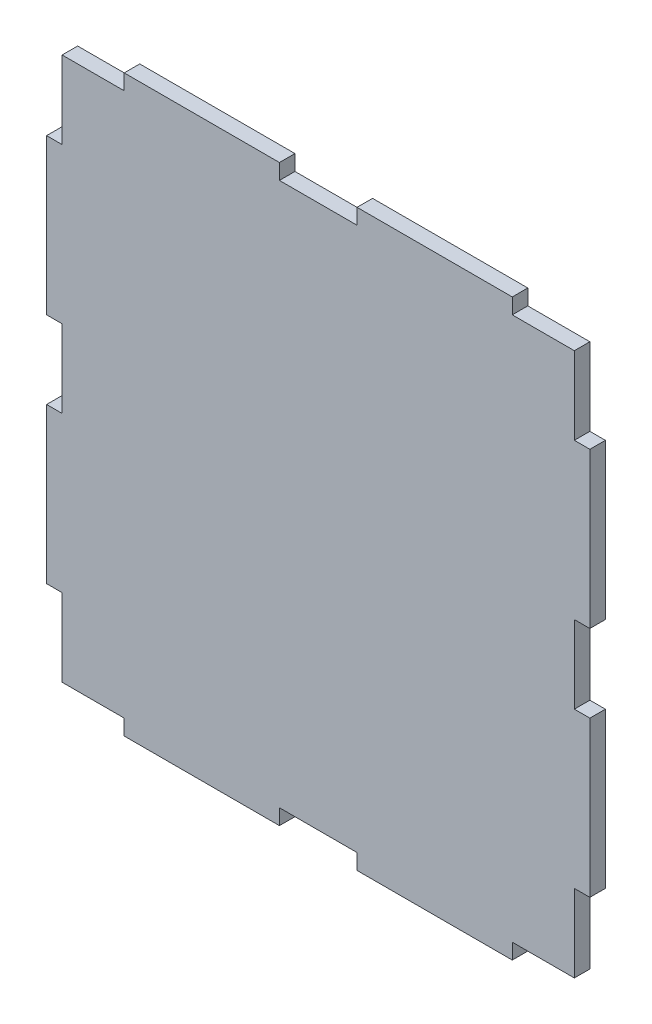
ISO-10303-21;
HEADER;
FILE_DESCRIPTION(('STEP AP214'),'2;1');
FILE_NAME('part.step','',(''),(''),'','','');
FILE_SCHEMA(('AUTOMOTIVE_DESIGN { 1 0 10303 214 1 1 1 1 }'));
ENDSEC;
DATA;
#1=APPLICATION_CONTEXT('core data for automotive mechanical design processes');
#2=APPLICATION_PROTOCOL_DEFINITION('international standard','automotive_design',2000,#1);
#3=PRODUCT_CONTEXT('',#1,'mechanical');
#4=PRODUCT('Part','Part','',(#3));
#5=PRODUCT_RELATED_PRODUCT_CATEGORY('part','',(#4));
#6=PRODUCT_DEFINITION_FORMATION('','',#4);
#7=PRODUCT_DEFINITION_CONTEXT('part definition',#1,'design');
#8=PRODUCT_DEFINITION('design','',#6,#7);
#9=PRODUCT_DEFINITION_SHAPE('','',#8);
#10=(LENGTH_UNIT() NAMED_UNIT(*) SI_UNIT(.MILLI.,.METRE.));
#11=(NAMED_UNIT(*) PLANE_ANGLE_UNIT() SI_UNIT($,.RADIAN.));
#12=(NAMED_UNIT(*) SI_UNIT($,.STERADIAN.) SOLID_ANGLE_UNIT());
#13=UNCERTAINTY_MEASURE_WITH_UNIT(LENGTH_MEASURE(1.E-05),#10,'distance_accuracy_value','');
#14=(GEOMETRIC_REPRESENTATION_CONTEXT(3) GLOBAL_UNCERTAINTY_ASSIGNED_CONTEXT((#13)) GLOBAL_UNIT_ASSIGNED_CONTEXT((#10,
#11,#12)) REPRESENTATION_CONTEXT('',''));
#15=CARTESIAN_POINT('',(0.,0.,0.));
#16=DIRECTION('',(0.,0.,1.));
#17=DIRECTION('',(1.,0.,0.));
#18=AXIS2_PLACEMENT_3D('',#15,#16,#17);
#19=CARTESIAN_POINT('',(-33.,-35.,2.));
#20=DIRECTION('',(0.,1.,0.));
#21=DIRECTION('',(0.,0.,1.));
#22=AXIS2_PLACEMENT_3D('',#19,#20,#21);
#23=PLANE('',#22);
#24=DIRECTION('',(0.,0.,-1.));
#25=VECTOR('',#24,1.);
#26=CARTESIAN_POINT('',(-25.,-35.,2.));
#27=LINE('',#26,#25);
#28=CARTESIAN_POINT('',(-25.,-35.,2.));
#29=VERTEX_POINT('',#28);
#30=CARTESIAN_POINT('',(-25.,-35.,0.));
#31=VERTEX_POINT('',#30);
#32=EDGE_CURVE('E58',#29,#31,#27,.T.);
#33=ORIENTED_EDGE('',*,*,#32,.F.);
#34=DIRECTION('',(1.,0.,0.));
#35=VECTOR('',#34,1.);
#36=CARTESIAN_POINT('',(-33.,-35.,2.));
#37=LINE('',#36,#35);
#38=CARTESIAN_POINT('',(-33.,-35.,2.));
#39=VERTEX_POINT('',#38);
#40=EDGE_CURVE('E506',#39,#29,#37,.T.);
#41=ORIENTED_EDGE('',*,*,#40,.F.);
#42=DIRECTION('',(0.,0.,-1.));
#43=VECTOR('',#42,1.);
#44=CARTESIAN_POINT('',(-33.,-35.,2.));
#45=LINE('',#44,#43);
#46=CARTESIAN_POINT('',(-33.,-35.,0.));
#47=VERTEX_POINT('',#46);
#48=EDGE_CURVE('E528',#39,#47,#45,.T.);
#49=ORIENTED_EDGE('',*,*,#48,.T.);
#50=DIRECTION('',(1.,0.,0.));
#51=VECTOR('',#50,1.);
#52=CARTESIAN_POINT('',(-33.,-35.,0.));
#53=LINE('',#52,#51);
#54=EDGE_CURVE('E523',#47,#31,#53,.T.);
#55=ORIENTED_EDGE('',*,*,#54,.T.);
#56=EDGE_LOOP('',(#33,#41,#49,#55));
#57=FACE_BOUND('',#56,.T.);
#58=ADVANCED_FACE('F35',(#57),#23,.F.);
#59=DIRECTION('',(0.,0.,-1.));
#60=VECTOR('',#59,1.);
#61=CARTESIAN_POINT('',(-5.,-35.,2.));
#62=LINE('',#61,#60);
#63=CARTESIAN_POINT('',(-5.,-35.,2.));
#64=VERTEX_POINT('',#63);
#65=CARTESIAN_POINT('',(-5.,-35.,0.));
#66=VERTEX_POINT('',#65);
#67=EDGE_CURVE('E281',#64,#66,#62,.T.);
#68=ORIENTED_EDGE('',*,*,#67,.T.);
#69=CARTESIAN_POINT('',(5.,-35.,0.));
#70=VERTEX_POINT('',#69);
#71=EDGE_CURVE('E525',#66,#70,#53,.T.);
#72=ORIENTED_EDGE('',*,*,#71,.T.);
#73=DIRECTION('',(0.,0.,-1.));
#74=VECTOR('',#73,1.);
#75=CARTESIAN_POINT('',(5.,-35.,2.));
#76=LINE('',#75,#74);
#77=CARTESIAN_POINT('',(5.,-35.,2.));
#78=VERTEX_POINT('',#77);
#79=EDGE_CURVE('E323',#78,#70,#76,.T.);
#80=ORIENTED_EDGE('',*,*,#79,.F.);
#81=EDGE_CURVE('E50',#64,#78,#37,.T.);
#82=ORIENTED_EDGE('',*,*,#81,.F.);
#83=EDGE_LOOP('',(#68,#72,#80,#82));
#84=FACE_BOUND('',#83,.T.);
#85=ADVANCED_FACE('F627',(#84),#23,.F.);
#86=CARTESIAN_POINT('',(-33.,35.,2.));
#87=DIRECTION('',(0.,-1.,0.));
#88=DIRECTION('',(0.,0.,-1.));
#89=AXIS2_PLACEMENT_3D('',#86,#87,#88);
#90=PLANE('',#89);
#91=DIRECTION('',(0.,0.,-1.));
#92=VECTOR('',#91,1.);
#93=CARTESIAN_POINT('',(-5.,35.,2.));
#94=LINE('',#93,#92);
#95=CARTESIAN_POINT('',(-5.,35.,2.));
#96=VERTEX_POINT('',#95);
#97=CARTESIAN_POINT('',(-5.,35.,0.));
#98=VERTEX_POINT('',#97);
#99=EDGE_CURVE('E348',#96,#98,#94,.T.);
#100=ORIENTED_EDGE('',*,*,#99,.F.);
#101=DIRECTION('',(-1.,0.,0.));
#102=VECTOR('',#101,1.);
#103=CARTESIAN_POINT('',(-33.,35.,2.));
#104=LINE('',#103,#102);
#105=CARTESIAN_POINT('',(5.,35.,2.));
#106=VERTEX_POINT('',#105);
#107=EDGE_CURVE('E500',#106,#96,#104,.T.);
#108=ORIENTED_EDGE('',*,*,#107,.F.);
#109=DIRECTION('',(0.,0.,-1.));
#110=VECTOR('',#109,1.);
#111=CARTESIAN_POINT('',(5.,35.,2.));
#112=LINE('',#111,#110);
#113=CARTESIAN_POINT('',(5.,35.,0.));
#114=VERTEX_POINT('',#113);
#115=EDGE_CURVE('E377',#106,#114,#112,.T.);
#116=ORIENTED_EDGE('',*,*,#115,.T.);
#117=DIRECTION('',(-1.,0.,0.));
#118=VECTOR('',#117,1.);
#119=CARTESIAN_POINT('',(-33.,35.,0.));
#120=LINE('',#119,#118);
#121=EDGE_CURVE('E518',#114,#98,#120,.T.);
#122=ORIENTED_EDGE('',*,*,#121,.T.);
#123=EDGE_LOOP('',(#100,#108,#116,#122));
#124=FACE_BOUND('',#123,.T.);
#125=ADVANCED_FACE('F568',(#124),#90,.F.);
#126=DIRECTION('',(0.,0.,-1.));
#127=VECTOR('',#126,1.);
#128=CARTESIAN_POINT('',(25.,35.,2.));
#129=LINE('',#128,#127);
#130=CARTESIAN_POINT('',(25.,35.,2.));
#131=VERTEX_POINT('',#130);
#132=CARTESIAN_POINT('',(25.,35.,0.));
#133=VERTEX_POINT('',#132);
#134=EDGE_CURVE('E380',#131,#133,#129,.T.);
#135=ORIENTED_EDGE('',*,*,#134,.F.);
#136=CARTESIAN_POINT('',(33.,35.,2.));
#137=VERTEX_POINT('',#136);
#138=EDGE_CURVE('E496',#137,#131,#104,.T.);
#139=ORIENTED_EDGE('',*,*,#138,.F.);
#140=DIRECTION('',(0.,0.,-1.));
#141=VECTOR('',#140,1.);
#142=CARTESIAN_POINT('',(33.,35.,2.));
#143=LINE('',#142,#141);
#144=CARTESIAN_POINT('',(33.,35.,0.));
#145=VERTEX_POINT('',#144);
#146=EDGE_CURVE('E11',#137,#145,#143,.T.);
#147=ORIENTED_EDGE('',*,*,#146,.T.);
#148=EDGE_CURVE('E514',#145,#133,#120,.T.);
#149=ORIENTED_EDGE('',*,*,#148,.T.);
#150=EDGE_LOOP('',(#135,#139,#147,#149));
#151=FACE_BOUND('',#150,.T.);
#152=ADVANCED_FACE('F583',(#151),#90,.F.);
#153=CARTESIAN_POINT('',(33.,-35.,2.));
#154=DIRECTION('',(-1.,0.,0.));
#155=DIRECTION('',(0.,0.,1.));
#156=AXIS2_PLACEMENT_3D('',#153,#154,#155);
#157=PLANE('',#156);
#158=DIRECTION('',(0.,0.,-1.));
#159=VECTOR('',#158,1.);
#160=CARTESIAN_POINT('',(33.,5.,2.));
#161=LINE('',#160,#159);
#162=CARTESIAN_POINT('',(33.,5.,2.));
#163=VERTEX_POINT('',#162);
#164=CARTESIAN_POINT('',(33.,5.,0.));
#165=VERTEX_POINT('',#164);
#166=EDGE_CURVE('E405',#163,#165,#161,.T.);
#167=ORIENTED_EDGE('',*,*,#166,.F.);
#168=DIRECTION('',(0.,1.,0.));
#169=VECTOR('',#168,1.);
#170=CARTESIAN_POINT('',(33.,-35.,2.));
#171=LINE('',#170,#169);
#172=CARTESIAN_POINT('',(33.,-5.,2.));
#173=VERTEX_POINT('',#172);
#174=EDGE_CURVE('E494',#173,#163,#171,.T.);
#175=ORIENTED_EDGE('',*,*,#174,.F.);
#176=DIRECTION('',(0.,0.,-1.));
#177=VECTOR('',#176,1.);
#178=CARTESIAN_POINT('',(33.,-5.,2.));
#179=LINE('',#178,#177);
#180=CARTESIAN_POINT('',(33.,-5.,0.));
#181=VERTEX_POINT('',#180);
#182=EDGE_CURVE('E427',#173,#181,#179,.T.);
#183=ORIENTED_EDGE('',*,*,#182,.T.);
#184=DIRECTION('',(0.,1.,0.));
#185=VECTOR('',#184,1.);
#186=CARTESIAN_POINT('',(33.,-35.,0.));
#187=LINE('',#186,#185);
#188=EDGE_CURVE('E513',#181,#165,#187,.T.);
#189=ORIENTED_EDGE('',*,*,#188,.T.);
#190=EDGE_LOOP('',(#167,#175,#183,#189));
#191=FACE_BOUND('',#190,.T.);
#192=ADVANCED_FACE('F591',(#191),#157,.F.);
#193=DIRECTION('',(0.,0.,-1.));
#194=VECTOR('',#193,1.);
#195=CARTESIAN_POINT('',(33.,-25.,2.));
#196=LINE('',#195,#194);
#197=CARTESIAN_POINT('',(33.,-25.,2.));
#198=VERTEX_POINT('',#197);
#199=CARTESIAN_POINT('',(33.,-25.,0.));
#200=VERTEX_POINT('',#199);
#201=EDGE_CURVE('E431',#198,#200,#196,.T.);
#202=ORIENTED_EDGE('',*,*,#201,.F.);
#203=CARTESIAN_POINT('',(33.,-35.,2.));
#204=VERTEX_POINT('',#203);
#205=EDGE_CURVE('E491',#204,#198,#171,.T.);
#206=ORIENTED_EDGE('',*,*,#205,.F.);
#207=DIRECTION('',(0.,0.,-1.));
#208=VECTOR('',#207,1.);
#209=CARTESIAN_POINT('',(33.,-35.,2.));
#210=LINE('',#209,#208);
#211=CARTESIAN_POINT('',(33.,-35.,0.));
#212=VERTEX_POINT('',#211);
#213=EDGE_CURVE('E508',#204,#212,#210,.T.);
#214=ORIENTED_EDGE('',*,*,#213,.T.);
#215=EDGE_CURVE('E509',#212,#200,#187,.T.);
#216=ORIENTED_EDGE('',*,*,#215,.T.);
#217=EDGE_LOOP('',(#202,#206,#214,#216));
#218=FACE_BOUND('',#217,.T.);
#219=ADVANCED_FACE('F619',(#218),#157,.F.);
#220=CARTESIAN_POINT('',(-33.,-35.,2.));
#221=DIRECTION('',(1.,0.,0.));
#222=DIRECTION('',(0.,0.,-1.));
#223=AXIS2_PLACEMENT_3D('',#220,#221,#222);
#224=PLANE('',#223);
#225=DIRECTION('',(0.,0.,-1.));
#226=VECTOR('',#225,1.);
#227=CARTESIAN_POINT('',(-33.,5.,2.));
#228=LINE('',#227,#226);
#229=CARTESIAN_POINT('',(-33.,5.,2.));
#230=VERTEX_POINT('',#229);
#231=CARTESIAN_POINT('',(-33.,5.,0.));
#232=VERTEX_POINT('',#231);
#233=EDGE_CURVE('E457',#230,#232,#228,.T.);
#234=ORIENTED_EDGE('',*,*,#233,.T.);
#235=DIRECTION('',(0.,-1.,0.));
#236=VECTOR('',#235,1.);
#237=CARTESIAN_POINT('',(-33.,-35.,0.));
#238=LINE('',#237,#236);
#239=CARTESIAN_POINT('',(-33.,-5.,0.));
#240=VERTEX_POINT('',#239);
#241=EDGE_CURVE('E522',#232,#240,#238,.T.);
#242=ORIENTED_EDGE('',*,*,#241,.T.);
#243=DIRECTION('',(0.,0.,-1.));
#244=VECTOR('',#243,1.);
#245=CARTESIAN_POINT('',(-33.,-5.,2.));
#246=LINE('',#245,#244);
#247=CARTESIAN_POINT('',(-33.,-5.,2.));
#248=VERTEX_POINT('',#247);
#249=EDGE_CURVE('E487',#248,#240,#246,.T.);
#250=ORIENTED_EDGE('',*,*,#249,.F.);
#251=DIRECTION('',(0.,-1.,0.));
#252=VECTOR('',#251,1.);
#253=CARTESIAN_POINT('',(-33.,-35.,2.));
#254=LINE('',#253,#252);
#255=EDGE_CURVE('E505',#230,#248,#254,.T.);
#256=ORIENTED_EDGE('',*,*,#255,.F.);
#257=EDGE_LOOP('',(#234,#242,#250,#256));
#258=FACE_BOUND('',#257,.T.);
#259=ADVANCED_FACE('F664',(#258),#224,.F.);
#260=CARTESIAN_POINT('',(-33.,35.,0.));
#261=VERTEX_POINT('',#260);
#262=CARTESIAN_POINT('',(-33.,25.,0.));
#263=VERTEX_POINT('',#262);
#264=EDGE_CURVE('E519',#261,#263,#238,.T.);
#265=ORIENTED_EDGE('',*,*,#264,.T.);
#266=DIRECTION('',(0.,0.,-1.));
#267=VECTOR('',#266,1.);
#268=CARTESIAN_POINT('',(-33.,25.,2.));
#269=LINE('',#268,#267);
#270=CARTESIAN_POINT('',(-33.,25.,2.));
#271=VERTEX_POINT('',#270);
#272=EDGE_CURVE('E460',#271,#263,#269,.T.);
#273=ORIENTED_EDGE('',*,*,#272,.F.);
#274=CARTESIAN_POINT('',(-33.,35.,2.));
#275=VERTEX_POINT('',#274);
#276=EDGE_CURVE('E501',#275,#271,#254,.T.);
#277=ORIENTED_EDGE('',*,*,#276,.F.);
#278=DIRECTION('',(0.,0.,-1.));
#279=VECTOR('',#278,1.);
#280=CARTESIAN_POINT('',(-33.,35.,2.));
#281=LINE('',#280,#279);
#282=EDGE_CURVE('E43',#275,#261,#281,.T.);
#283=ORIENTED_EDGE('',*,*,#282,.T.);
#284=EDGE_LOOP('',(#265,#273,#277,#283));
#285=FACE_BOUND('',#284,.T.);
#286=ADVANCED_FACE('F535',(#285),#224,.F.);
#287=CARTESIAN_POINT('',(33.,25.,2.));
#288=VERTEX_POINT('',#287);
#289=EDGE_CURVE('E495',#288,#137,#171,.T.);
#290=ORIENTED_EDGE('',*,*,#289,.F.);
#291=DIRECTION('',(0.,0.,-1.));
#292=VECTOR('',#291,1.);
#293=CARTESIAN_POINT('',(33.,25.,2.));
#294=LINE('',#293,#292);
#295=CARTESIAN_POINT('',(33.,25.,0.));
#296=VERTEX_POINT('',#295);
#297=EDGE_CURVE('E402',#288,#296,#294,.T.);
#298=ORIENTED_EDGE('',*,*,#297,.T.);
#299=EDGE_CURVE('E483',#296,#145,#187,.T.);
#300=ORIENTED_EDGE('',*,*,#299,.T.);
#301=ORIENTED_EDGE('',*,*,#146,.F.);
#302=EDGE_LOOP('',(#290,#298,#300,#301));
#303=FACE_BOUND('',#302,.T.);
#304=ADVANCED_FACE('F37',(#303),#157,.F.);
#305=CARTESIAN_POINT('',(-25.,35.,2.));
#306=VERTEX_POINT('',#305);
#307=EDGE_CURVE('E493',#306,#275,#104,.T.);
#308=ORIENTED_EDGE('',*,*,#307,.F.);
#309=DIRECTION('',(0.,0.,-1.));
#310=VECTOR('',#309,1.);
#311=CARTESIAN_POINT('',(-25.,35.,2.));
#312=LINE('',#311,#310);
#313=CARTESIAN_POINT('',(-25.,35.,0.));
#314=VERTEX_POINT('',#313);
#315=EDGE_CURVE('E341',#306,#314,#312,.T.);
#316=ORIENTED_EDGE('',*,*,#315,.T.);
#317=EDGE_CURVE('E512',#314,#261,#120,.T.);
#318=ORIENTED_EDGE('',*,*,#317,.T.);
#319=ORIENTED_EDGE('',*,*,#282,.F.);
#320=EDGE_LOOP('',(#308,#316,#318,#319));
#321=FACE_BOUND('',#320,.T.);
#322=ADVANCED_FACE('F566',(#321),#90,.F.);
#323=CARTESIAN_POINT('',(-33.,-25.,2.));
#324=VERTEX_POINT('',#323);
#325=EDGE_CURVE('E499',#324,#39,#254,.T.);
#326=ORIENTED_EDGE('',*,*,#325,.F.);
#327=DIRECTION('',(0.,0.,-1.));
#328=VECTOR('',#327,1.);
#329=CARTESIAN_POINT('',(-33.,-25.,2.));
#330=LINE('',#329,#328);
#331=CARTESIAN_POINT('',(-33.,-25.,0.));
#332=VERTEX_POINT('',#331);
#333=EDGE_CURVE('E484',#324,#332,#330,.T.);
#334=ORIENTED_EDGE('',*,*,#333,.T.);
#335=EDGE_CURVE('E517',#332,#47,#238,.T.);
#336=ORIENTED_EDGE('',*,*,#335,.T.);
#337=ORIENTED_EDGE('',*,*,#48,.F.);
#338=EDGE_LOOP('',(#326,#334,#336,#337));
#339=FACE_BOUND('',#338,.T.);
#340=ADVANCED_FACE('F657',(#339),#224,.F.);
#341=CARTESIAN_POINT('',(25.,-35.,2.));
#342=VERTEX_POINT('',#341);
#343=EDGE_CURVE('E504',#342,#204,#37,.T.);
#344=ORIENTED_EDGE('',*,*,#343,.F.);
#345=DIRECTION('',(0.,0.,-1.));
#346=VECTOR('',#345,1.);
#347=CARTESIAN_POINT('',(25.,-35.,2.));
#348=LINE('',#347,#346);
#349=CARTESIAN_POINT('',(25.,-35.,0.));
#350=VERTEX_POINT('',#349);
#351=EDGE_CURVE('E315',#342,#350,#348,.T.);
#352=ORIENTED_EDGE('',*,*,#351,.T.);
#353=EDGE_CURVE('E521',#350,#212,#53,.T.);
#354=ORIENTED_EDGE('',*,*,#353,.T.);
#355=ORIENTED_EDGE('',*,*,#213,.F.);
#356=EDGE_LOOP('',(#344,#352,#354,#355));
#357=FACE_BOUND('',#356,.T.);
#358=ADVANCED_FACE('F624',(#357),#23,.F.);
#359=CARTESIAN_POINT('',(0.,0.,2.));
#360=DIRECTION('',(0.,0.,-1.));
#361=DIRECTION('',(-1.,0.,0.));
#362=AXIS2_PLACEMENT_3D('',#359,#360,#361);
#363=PLANE('',#362);
#364=ORIENTED_EDGE('',*,*,#205,.T.);
#365=DIRECTION('',(1.,0.,0.));
#366=VECTOR('',#365,1.);
#367=CARTESIAN_POINT('',(0.,-25.,2.));
#368=LINE('',#367,#366);
#369=CARTESIAN_POINT('',(35.,-25.,2.));
#370=VERTEX_POINT('',#369);
#371=EDGE_CURVE('E417',#198,#370,#368,.T.);
#372=ORIENTED_EDGE('',*,*,#371,.T.);
#373=DIRECTION('',(0.,-1.,0.));
#374=VECTOR('',#373,1.);
#375=CARTESIAN_POINT('',(35.,0.,2.));
#376=LINE('',#375,#374);
#377=CARTESIAN_POINT('',(35.,-5.,2.));
#378=VERTEX_POINT('',#377);
#379=EDGE_CURVE('E413',#378,#370,#376,.T.);
#380=ORIENTED_EDGE('',*,*,#379,.F.);
#381=DIRECTION('',(1.,0.,0.));
#382=VECTOR('',#381,1.);
#383=CARTESIAN_POINT('',(0.,-5.00000000000001,2.));
#384=LINE('',#383,#382);
#385=EDGE_CURVE('E410',#173,#378,#384,.T.);
#386=ORIENTED_EDGE('',*,*,#385,.F.);
#387=ORIENTED_EDGE('',*,*,#174,.T.);
#388=DIRECTION('',(1.,0.,0.));
#389=VECTOR('',#388,1.);
#390=CARTESIAN_POINT('',(0.,5.,2.));
#391=LINE('',#390,#389);
#392=CARTESIAN_POINT('',(35.,5.,2.));
#393=VERTEX_POINT('',#392);
#394=EDGE_CURVE('E386',#163,#393,#391,.T.);
#395=ORIENTED_EDGE('',*,*,#394,.T.);
#396=DIRECTION('',(0.,1.,0.));
#397=VECTOR('',#396,1.);
#398=CARTESIAN_POINT('',(35.,0.,2.));
#399=LINE('',#398,#397);
#400=CARTESIAN_POINT('',(35.,25.,2.));
#401=VERTEX_POINT('',#400);
#402=EDGE_CURVE('E384',#393,#401,#399,.T.);
#403=ORIENTED_EDGE('',*,*,#402,.T.);
#404=DIRECTION('',(1.,0.,0.));
#405=VECTOR('',#404,1.);
#406=CARTESIAN_POINT('',(0.,25.,2.));
#407=LINE('',#406,#405);
#408=EDGE_CURVE('E389',#288,#401,#407,.T.);
#409=ORIENTED_EDGE('',*,*,#408,.F.);
#410=ORIENTED_EDGE('',*,*,#289,.T.);
#411=ORIENTED_EDGE('',*,*,#138,.T.);
#412=DIRECTION('',(0.,1.,0.));
#413=VECTOR('',#412,1.);
#414=CARTESIAN_POINT('',(25.,0.,2.));
#415=LINE('',#414,#413);
#416=CARTESIAN_POINT('',(25.,37.,2.));
#417=VERTEX_POINT('',#416);
#418=EDGE_CURVE('E361',#131,#417,#415,.T.);
#419=ORIENTED_EDGE('',*,*,#418,.T.);
#420=DIRECTION('',(-1.,0.,0.));
#421=VECTOR('',#420,1.);
#422=CARTESIAN_POINT('',(0.,37.,2.));
#423=LINE('',#422,#421);
#424=CARTESIAN_POINT('',(5.,37.,2.));
#425=VERTEX_POINT('',#424);
#426=EDGE_CURVE('E359',#417,#425,#423,.T.);
#427=ORIENTED_EDGE('',*,*,#426,.T.);
#428=DIRECTION('',(0.,1.,0.));
#429=VECTOR('',#428,1.);
#430=CARTESIAN_POINT('',(5.,0.,2.));
#431=LINE('',#430,#429);
#432=EDGE_CURVE('E364',#106,#425,#431,.T.);
#433=ORIENTED_EDGE('',*,*,#432,.F.);
#434=ORIENTED_EDGE('',*,*,#107,.T.);
#435=DIRECTION('',(0.,1.,0.));
#436=VECTOR('',#435,1.);
#437=CARTESIAN_POINT('',(-5.,0.,2.));
#438=LINE('',#437,#436);
#439=CARTESIAN_POINT('',(-5.,37.,2.));
#440=VERTEX_POINT('',#439);
#441=EDGE_CURVE('E339',#96,#440,#438,.T.);
#442=ORIENTED_EDGE('',*,*,#441,.T.);
#443=DIRECTION('',(-1.,0.,0.));
#444=VECTOR('',#443,1.);
#445=CARTESIAN_POINT('',(0.,37.,2.));
#446=LINE('',#445,#444);
#447=CARTESIAN_POINT('',(-25.,37.,2.));
#448=VERTEX_POINT('',#447);
#449=EDGE_CURVE('E336',#440,#448,#446,.T.);
#450=ORIENTED_EDGE('',*,*,#449,.T.);
#451=DIRECTION('',(0.,1.,0.));
#452=VECTOR('',#451,1.);
#453=CARTESIAN_POINT('',(-25.,0.,2.));
#454=LINE('',#453,#452);
#455=EDGE_CURVE('E333',#306,#448,#454,.T.);
#456=ORIENTED_EDGE('',*,*,#455,.F.);
#457=ORIENTED_EDGE('',*,*,#307,.T.);
#458=ORIENTED_EDGE('',*,*,#276,.T.);
#459=DIRECTION('',(1.,0.,0.));
#460=VECTOR('',#459,1.);
#461=CARTESIAN_POINT('',(0.,25.,2.));
#462=LINE('',#461,#460);
#463=CARTESIAN_POINT('',(-35.,25.,2.));
#464=VERTEX_POINT('',#463);
#465=EDGE_CURVE('E439',#464,#271,#462,.T.);
#466=ORIENTED_EDGE('',*,*,#465,.F.);
#467=DIRECTION('',(0.,1.,0.));
#468=VECTOR('',#467,1.);
#469=CARTESIAN_POINT('',(-35.,0.,2.));
#470=LINE('',#469,#468);
#471=CARTESIAN_POINT('',(-35.,5.,2.));
#472=VERTEX_POINT('',#471);
#473=EDGE_CURVE('E436',#472,#464,#470,.T.);
#474=ORIENTED_EDGE('',*,*,#473,.F.);
#475=DIRECTION('',(1.,0.,0.));
#476=VECTOR('',#475,1.);
#477=CARTESIAN_POINT('',(0.,5.,2.));
#478=LINE('',#477,#476);
#479=EDGE_CURVE('E443',#472,#230,#478,.T.);
#480=ORIENTED_EDGE('',*,*,#479,.T.);
#481=ORIENTED_EDGE('',*,*,#255,.T.);
#482=DIRECTION('',(1.,0.,0.));
#483=VECTOR('',#482,1.);
#484=CARTESIAN_POINT('',(0.,-4.99999999999999,2.));
#485=LINE('',#484,#483);
#486=CARTESIAN_POINT('',(-35.,-5.,2.));
#487=VERTEX_POINT('',#486);
#488=EDGE_CURVE('E466',#487,#248,#485,.T.);
#489=ORIENTED_EDGE('',*,*,#488,.F.);
#490=DIRECTION('',(0.,-1.,0.));
#491=VECTOR('',#490,1.);
#492=CARTESIAN_POINT('',(-35.,0.,2.));
#493=LINE('',#492,#491);
#494=CARTESIAN_POINT('',(-35.,-25.,2.));
#495=VERTEX_POINT('',#494);
#496=EDGE_CURVE('E464',#487,#495,#493,.T.);
#497=ORIENTED_EDGE('',*,*,#496,.T.);
#498=DIRECTION('',(-1.,0.,0.));
#499=VECTOR('',#498,1.);
#500=CARTESIAN_POINT('',(0.,-25.,2.));
#501=LINE('',#500,#499);
#502=EDGE_CURVE('E470',#324,#495,#501,.T.);
#503=ORIENTED_EDGE('',*,*,#502,.F.);
#504=ORIENTED_EDGE('',*,*,#325,.T.);
#505=ORIENTED_EDGE('',*,*,#40,.T.);
#506=DIRECTION('',(0.,-1.,0.));
#507=VECTOR('',#506,1.);
#508=CARTESIAN_POINT('',(-25.,0.,2.));
#509=LINE('',#508,#507);
#510=CARTESIAN_POINT('',(-25.,-37.,2.));
#511=VERTEX_POINT('',#510);
#512=EDGE_CURVE('E287',#29,#511,#509,.T.);
#513=ORIENTED_EDGE('',*,*,#512,.T.);
#514=DIRECTION('',(-1.,0.,0.));
#515=VECTOR('',#514,1.);
#516=CARTESIAN_POINT('',(0.,-37.,2.));
#517=LINE('',#516,#515);
#518=CARTESIAN_POINT('',(-5.,-37.,2.));
#519=VERTEX_POINT('',#518);
#520=EDGE_CURVE('E274',#519,#511,#517,.T.);
#521=ORIENTED_EDGE('',*,*,#520,.F.);
#522=DIRECTION('',(0.,1.,0.));
#523=VECTOR('',#522,1.);
#524=CARTESIAN_POINT('',(-5.,0.,2.));
#525=LINE('',#524,#523);
#526=EDGE_CURVE('E284',#519,#64,#525,.T.);
#527=ORIENTED_EDGE('',*,*,#526,.T.);
#528=ORIENTED_EDGE('',*,*,#81,.T.);
#529=DIRECTION('',(0.,1.,0.));
#530=VECTOR('',#529,1.);
#531=CARTESIAN_POINT('',(4.99999999999999,0.,2.));
#532=LINE('',#531,#530);
#533=CARTESIAN_POINT('',(5.,-37.,2.));
#534=VERTEX_POINT('',#533);
#535=EDGE_CURVE('E312',#534,#78,#532,.T.);
#536=ORIENTED_EDGE('',*,*,#535,.F.);
#537=DIRECTION('',(1.,0.,0.));
#538=VECTOR('',#537,1.);
#539=CARTESIAN_POINT('',(0.,-37.,2.));
#540=LINE('',#539,#538);
#541=CARTESIAN_POINT('',(25.,-37.,2.));
#542=VERTEX_POINT('',#541);
#543=EDGE_CURVE('E309',#534,#542,#540,.T.);
#544=ORIENTED_EDGE('',*,*,#543,.T.);
#545=DIRECTION('',(0.,-1.,0.));
#546=VECTOR('',#545,1.);
#547=CARTESIAN_POINT('',(25.,0.,2.));
#548=LINE('',#547,#546);
#549=EDGE_CURVE('E306',#342,#542,#548,.T.);
#550=ORIENTED_EDGE('',*,*,#549,.F.);
#551=ORIENTED_EDGE('',*,*,#343,.T.);
#552=EDGE_LOOP('',(#364,#372,#380,#386,#387,#395,#403,#409,#410,#411,#419,#427,#433,#434,#442,
#450,#456,#457,#458,#466,#474,#480,#481,#489,#497,#503,#504,#505,#513,#521,#527,#528,#536,#544,
#550,#551));
#553=FACE_BOUND('',#552,.T.);
#554=ADVANCED_FACE('F290',(#553),#363,.F.);
#555=CARTESIAN_POINT('',(0.,0.,0.));
#556=DIRECTION('',(0.,0.,-1.));
#557=DIRECTION('',(-1.,0.,0.));
#558=AXIS2_PLACEMENT_3D('',#555,#556,#557);
#559=PLANE('',#558);
#560=ORIENTED_EDGE('',*,*,#215,.F.);
#561=ORIENTED_EDGE('',*,*,#353,.F.);
#562=DIRECTION('',(0.,-1.,0.));
#563=VECTOR('',#562,1.);
#564=CARTESIAN_POINT('',(25.,0.,0.));
#565=LINE('',#564,#563);
#566=CARTESIAN_POINT('',(25.,-37.,0.));
#567=VERTEX_POINT('',#566);
#568=EDGE_CURVE('E303',#350,#567,#565,.T.);
#569=ORIENTED_EDGE('',*,*,#568,.T.);
#570=DIRECTION('',(1.,0.,0.));
#571=VECTOR('',#570,1.);
#572=CARTESIAN_POINT('',(0.,-37.,0.));
#573=LINE('',#572,#571);
#574=CARTESIAN_POINT('',(5.,-37.,0.));
#575=VERTEX_POINT('',#574);
#576=EDGE_CURVE('E318',#575,#567,#573,.T.);
#577=ORIENTED_EDGE('',*,*,#576,.F.);
#578=DIRECTION('',(0.,1.,0.));
#579=VECTOR('',#578,1.);
#580=CARTESIAN_POINT('',(4.99999999999999,0.,0.));
#581=LINE('',#580,#579);
#582=EDGE_CURVE('E310',#575,#70,#581,.T.);
#583=ORIENTED_EDGE('',*,*,#582,.T.);
#584=ORIENTED_EDGE('',*,*,#71,.F.);
#585=DIRECTION('',(0.,1.,0.));
#586=VECTOR('',#585,1.);
#587=CARTESIAN_POINT('',(-5.,0.,0.));
#588=LINE('',#587,#586);
#589=CARTESIAN_POINT('',(-5.,-37.,0.));
#590=VERTEX_POINT('',#589);
#591=EDGE_CURVE('E300',#590,#66,#588,.T.);
#592=ORIENTED_EDGE('',*,*,#591,.F.);
#593=DIRECTION('',(-1.,0.,0.));
#594=VECTOR('',#593,1.);
#595=CARTESIAN_POINT('',(0.,-37.,0.));
#596=LINE('',#595,#594);
#597=CARTESIAN_POINT('',(-25.,-37.,0.));
#598=VERTEX_POINT('',#597);
#599=EDGE_CURVE('E276',#590,#598,#596,.T.);
#600=ORIENTED_EDGE('',*,*,#599,.T.);
#601=DIRECTION('',(0.,-1.,0.));
#602=VECTOR('',#601,1.);
#603=CARTESIAN_POINT('',(-25.,0.,0.));
#604=LINE('',#603,#602);
#605=EDGE_CURVE('E297',#31,#598,#604,.T.);
#606=ORIENTED_EDGE('',*,*,#605,.F.);
#607=ORIENTED_EDGE('',*,*,#54,.F.);
#608=ORIENTED_EDGE('',*,*,#335,.F.);
#609=DIRECTION('',(-1.,0.,0.));
#610=VECTOR('',#609,1.);
#611=CARTESIAN_POINT('',(0.,-25.,0.));
#612=LINE('',#611,#610);
#613=CARTESIAN_POINT('',(-35.,-25.,0.));
#614=VERTEX_POINT('',#613);
#615=EDGE_CURVE('E467',#332,#614,#612,.T.);
#616=ORIENTED_EDGE('',*,*,#615,.T.);
#617=DIRECTION('',(0.,-1.,0.));
#618=VECTOR('',#617,1.);
#619=CARTESIAN_POINT('',(-35.,0.,0.));
#620=LINE('',#619,#618);
#621=CARTESIAN_POINT('',(-35.,-5.,0.));
#622=VERTEX_POINT('',#621);
#623=EDGE_CURVE('E456',#622,#614,#620,.T.);
#624=ORIENTED_EDGE('',*,*,#623,.F.);
#625=DIRECTION('',(1.,0.,0.));
#626=VECTOR('',#625,1.);
#627=CARTESIAN_POINT('',(0.,-4.99999999999999,0.));
#628=LINE('',#627,#626);
#629=EDGE_CURVE('E476',#622,#240,#628,.T.);
#630=ORIENTED_EDGE('',*,*,#629,.T.);
#631=ORIENTED_EDGE('',*,*,#241,.F.);
#632=DIRECTION('',(1.,0.,0.));
#633=VECTOR('',#632,1.);
#634=CARTESIAN_POINT('',(0.,5.,0.));
#635=LINE('',#634,#633);
#636=CARTESIAN_POINT('',(-35.,5.,0.));
#637=VERTEX_POINT('',#636);
#638=EDGE_CURVE('E440',#637,#232,#635,.T.);
#639=ORIENTED_EDGE('',*,*,#638,.F.);
#640=DIRECTION('',(0.,1.,0.));
#641=VECTOR('',#640,1.);
#642=CARTESIAN_POINT('',(-35.,0.,0.));
#643=LINE('',#642,#641);
#644=CARTESIAN_POINT('',(-35.,25.,0.));
#645=VERTEX_POINT('',#644);
#646=EDGE_CURVE('E430',#637,#645,#643,.T.);
#647=ORIENTED_EDGE('',*,*,#646,.T.);
#648=DIRECTION('',(1.,0.,0.));
#649=VECTOR('',#648,1.);
#650=CARTESIAN_POINT('',(0.,25.,0.));
#651=LINE('',#650,#649);
#652=EDGE_CURVE('E449',#645,#263,#651,.T.);
#653=ORIENTED_EDGE('',*,*,#652,.T.);
#654=ORIENTED_EDGE('',*,*,#264,.F.);
#655=ORIENTED_EDGE('',*,*,#317,.F.);
#656=DIRECTION('',(0.,1.,0.));
#657=VECTOR('',#656,1.);
#658=CARTESIAN_POINT('',(-25.,0.,0.));
#659=LINE('',#658,#657);
#660=CARTESIAN_POINT('',(-25.,37.,0.));
#661=VERTEX_POINT('',#660);
#662=EDGE_CURVE('E326',#314,#661,#659,.T.);
#663=ORIENTED_EDGE('',*,*,#662,.T.);
#664=DIRECTION('',(-1.,0.,0.));
#665=VECTOR('',#664,1.);
#666=CARTESIAN_POINT('',(0.,37.,0.));
#667=LINE('',#666,#665);
#668=CARTESIAN_POINT('',(-5.,37.,0.));
#669=VERTEX_POINT('',#668);
#670=EDGE_CURVE('E344',#669,#661,#667,.T.);
#671=ORIENTED_EDGE('',*,*,#670,.F.);
#672=DIRECTION('',(0.,1.,0.));
#673=VECTOR('',#672,1.);
#674=CARTESIAN_POINT('',(-5.,0.,0.));
#675=LINE('',#674,#673);
#676=EDGE_CURVE('E337',#98,#669,#675,.T.);
#677=ORIENTED_EDGE('',*,*,#676,.F.);
#678=ORIENTED_EDGE('',*,*,#121,.F.);
#679=DIRECTION('',(0.,1.,0.));
#680=VECTOR('',#679,1.);
#681=CARTESIAN_POINT('',(5.,0.,0.));
#682=LINE('',#681,#680);
#683=CARTESIAN_POINT('',(5.,37.,0.));
#684=VERTEX_POINT('',#683);
#685=EDGE_CURVE('E362',#114,#684,#682,.T.);
#686=ORIENTED_EDGE('',*,*,#685,.T.);
#687=DIRECTION('',(-1.,0.,0.));
#688=VECTOR('',#687,1.);
#689=CARTESIAN_POINT('',(0.,37.,0.));
#690=LINE('',#689,#688);
#691=CARTESIAN_POINT('',(25.,37.,0.));
#692=VERTEX_POINT('',#691);
#693=EDGE_CURVE('E351',#692,#684,#690,.T.);
#694=ORIENTED_EDGE('',*,*,#693,.F.);
#695=DIRECTION('',(0.,1.,0.));
#696=VECTOR('',#695,1.);
#697=CARTESIAN_POINT('',(25.,0.,0.));
#698=LINE('',#697,#696);
#699=EDGE_CURVE('E370',#133,#692,#698,.T.);
#700=ORIENTED_EDGE('',*,*,#699,.F.);
#701=ORIENTED_EDGE('',*,*,#148,.F.);
#702=ORIENTED_EDGE('',*,*,#299,.F.);
#703=DIRECTION('',(1.,0.,0.));
#704=VECTOR('',#703,1.);
#705=CARTESIAN_POINT('',(0.,25.,0.));
#706=LINE('',#705,#704);
#707=CARTESIAN_POINT('',(35.,25.,0.));
#708=VERTEX_POINT('',#707);
#709=EDGE_CURVE('E387',#296,#708,#706,.T.);
#710=ORIENTED_EDGE('',*,*,#709,.T.);
#711=DIRECTION('',(0.,1.,0.));
#712=VECTOR('',#711,1.);
#713=CARTESIAN_POINT('',(35.,0.,0.));
#714=LINE('',#713,#712);
#715=CARTESIAN_POINT('',(35.,5.,0.));
#716=VERTEX_POINT('',#715);
#717=EDGE_CURVE('E376',#716,#708,#714,.T.);
#718=ORIENTED_EDGE('',*,*,#717,.F.);
#719=DIRECTION('',(1.,0.,0.));
#720=VECTOR('',#719,1.);
#721=CARTESIAN_POINT('',(0.,5.,0.));
#722=LINE('',#721,#720);
#723=EDGE_CURVE('E395',#165,#716,#722,.T.);
#724=ORIENTED_EDGE('',*,*,#723,.F.);
#725=ORIENTED_EDGE('',*,*,#188,.F.);
#726=DIRECTION('',(1.,0.,0.));
#727=VECTOR('',#726,1.);
#728=CARTESIAN_POINT('',(0.,-5.00000000000001,0.));
#729=LINE('',#728,#727);
#730=CARTESIAN_POINT('',(35.,-5.,0.));
#731=VERTEX_POINT('',#730);
#732=EDGE_CURVE('E401',#181,#731,#729,.T.);
#733=ORIENTED_EDGE('',*,*,#732,.T.);
#734=DIRECTION('',(0.,-1.,0.));
#735=VECTOR('',#734,1.);
#736=CARTESIAN_POINT('',(35.,0.,0.));
#737=LINE('',#736,#735);
#738=CARTESIAN_POINT('',(35.,-25.,0.));
#739=VERTEX_POINT('',#738);
#740=EDGE_CURVE('E422',#731,#739,#737,.T.);
#741=ORIENTED_EDGE('',*,*,#740,.T.);
#742=DIRECTION('',(1.,0.,0.));
#743=VECTOR('',#742,1.);
#744=CARTESIAN_POINT('',(0.,-25.,0.));
#745=LINE('',#744,#743);
#746=EDGE_CURVE('E414',#200,#739,#745,.T.);
#747=ORIENTED_EDGE('',*,*,#746,.F.);
#748=EDGE_LOOP('',(#560,#561,#569,#577,#583,#584,#592,#600,#606,#607,#608,#616,#624,#630,#631,
#639,#647,#653,#654,#655,#663,#671,#677,#678,#686,#694,#700,#701,#702,#710,#718,#724,#725,#733,
#741,#747));
#749=FACE_BOUND('',#748,.T.);
#750=ADVANCED_FACE('F539',(#749),#559,.T.);
#751=CARTESIAN_POINT('',(-35.,0.,2.));
#752=DIRECTION('',(1.,0.,0.));
#753=DIRECTION('',(0.,0.,-1.));
#754=AXIS2_PLACEMENT_3D('',#751,#752,#753);
#755=PLANE('',#754);
#756=ORIENTED_EDGE('',*,*,#623,.T.);
#757=DIRECTION('',(0.,0.,-1.));
#758=VECTOR('',#757,1.);
#759=CARTESIAN_POINT('',(-35.,-25.,2.));
#760=LINE('',#759,#758);
#761=EDGE_CURVE('E481',#495,#614,#760,.T.);
#762=ORIENTED_EDGE('',*,*,#761,.F.);
#763=ORIENTED_EDGE('',*,*,#496,.F.);
#764=DIRECTION('',(0.,0.,-1.));
#765=VECTOR('',#764,1.);
#766=CARTESIAN_POINT('',(-35.,-5.,2.));
#767=LINE('',#766,#765);
#768=EDGE_CURVE('E473',#487,#622,#767,.T.);
#769=ORIENTED_EDGE('',*,*,#768,.T.);
#770=EDGE_LOOP('',(#756,#762,#763,#769));
#771=FACE_BOUND('',#770,.T.);
#772=ADVANCED_FACE('F708',(#771),#755,.F.);
#773=CARTESIAN_POINT('',(0.,-25.,2.));
#774=DIRECTION('',(0.,-1.,0.));
#775=DIRECTION('',(0.,0.,-1.));
#776=AXIS2_PLACEMENT_3D('',#773,#774,#775);
#777=PLANE('',#776);
#778=ORIENTED_EDGE('',*,*,#615,.F.);
#779=ORIENTED_EDGE('',*,*,#333,.F.);
#780=ORIENTED_EDGE('',*,*,#502,.T.);
#781=ORIENTED_EDGE('',*,*,#761,.T.);
#782=EDGE_LOOP('',(#778,#779,#780,#781));
#783=FACE_BOUND('',#782,.T.);
#784=ADVANCED_FACE('F713',(#783),#777,.T.);
#785=CARTESIAN_POINT('',(0.,-4.99999999999999,2.));
#786=DIRECTION('',(0.,1.,0.));
#787=DIRECTION('',(-1.,0.,0.));
#788=AXIS2_PLACEMENT_3D('',#785,#786,#787);
#789=PLANE('',#788);
#790=ORIENTED_EDGE('',*,*,#629,.F.);
#791=ORIENTED_EDGE('',*,*,#768,.F.);
#792=ORIENTED_EDGE('',*,*,#488,.T.);
#793=ORIENTED_EDGE('',*,*,#249,.T.);
#794=EDGE_LOOP('',(#790,#791,#792,#793));
#795=FACE_BOUND('',#794,.T.);
#796=ADVANCED_FACE('F725',(#795),#789,.T.);
#797=CARTESIAN_POINT('',(-35.,0.,2.));
#798=DIRECTION('',(-1.,0.,0.));
#799=DIRECTION('',(0.,0.,1.));
#800=AXIS2_PLACEMENT_3D('',#797,#798,#799);
#801=PLANE('',#800);
#802=ORIENTED_EDGE('',*,*,#646,.F.);
#803=DIRECTION('',(0.,0.,-1.));
#804=VECTOR('',#803,1.);
#805=CARTESIAN_POINT('',(-35.,5.,2.));
#806=LINE('',#805,#804);
#807=EDGE_CURVE('E454',#472,#637,#806,.T.);
#808=ORIENTED_EDGE('',*,*,#807,.F.);
#809=ORIENTED_EDGE('',*,*,#473,.T.);
#810=DIRECTION('',(0.,0.,-1.));
#811=VECTOR('',#810,1.);
#812=CARTESIAN_POINT('',(-35.,25.,2.));
#813=LINE('',#812,#811);
#814=EDGE_CURVE('E446',#464,#645,#813,.T.);
#815=ORIENTED_EDGE('',*,*,#814,.T.);
#816=EDGE_LOOP('',(#802,#808,#809,#815));
#817=FACE_BOUND('',#816,.T.);
#818=ADVANCED_FACE('F736',(#817),#801,.T.);
#819=CARTESIAN_POINT('',(0.,5.,2.));
#820=DIRECTION('',(0.,1.,0.));
#821=DIRECTION('',(0.,0.,1.));
#822=AXIS2_PLACEMENT_3D('',#819,#820,#821);
#823=PLANE('',#822);
#824=ORIENTED_EDGE('',*,*,#638,.T.);
#825=ORIENTED_EDGE('',*,*,#233,.F.);
#826=ORIENTED_EDGE('',*,*,#479,.F.);
#827=ORIENTED_EDGE('',*,*,#807,.T.);
#828=EDGE_LOOP('',(#824,#825,#826,#827));
#829=FACE_BOUND('',#828,.T.);
#830=ADVANCED_FACE('F746',(#829),#823,.F.);
#831=CARTESIAN_POINT('',(0.,25.,2.));
#832=DIRECTION('',(0.,1.,0.));
#833=DIRECTION('',(0.,0.,1.));
#834=AXIS2_PLACEMENT_3D('',#831,#832,#833);
#835=PLANE('',#834);
#836=ORIENTED_EDGE('',*,*,#652,.F.);
#837=ORIENTED_EDGE('',*,*,#814,.F.);
#838=ORIENTED_EDGE('',*,*,#465,.T.);
#839=ORIENTED_EDGE('',*,*,#272,.T.);
#840=EDGE_LOOP('',(#836,#837,#838,#839));
#841=FACE_BOUND('',#840,.T.);
#842=ADVANCED_FACE('F544',(#841),#835,.T.);
#843=CARTESIAN_POINT('',(0.,-5.00000000000001,2.));
#844=DIRECTION('',(0.,1.,0.));
#845=DIRECTION('',(-1.,0.,0.));
#846=AXIS2_PLACEMENT_3D('',#843,#844,#845);
#847=PLANE('',#846);
#848=ORIENTED_EDGE('',*,*,#732,.F.);
#849=ORIENTED_EDGE('',*,*,#182,.F.);
#850=ORIENTED_EDGE('',*,*,#385,.T.);
#851=DIRECTION('',(0.,0.,-1.));
#852=VECTOR('',#851,1.);
#853=CARTESIAN_POINT('',(35.,-5.,2.));
#854=LINE('',#853,#852);
#855=EDGE_CURVE('E419',#378,#731,#854,.T.);
#856=ORIENTED_EDGE('',*,*,#855,.T.);
#857=EDGE_LOOP('',(#848,#849,#850,#856));
#858=FACE_BOUND('',#857,.T.);
#859=ADVANCED_FACE('F608',(#858),#847,.T.);
#860=CARTESIAN_POINT('',(0.,-25.,2.));
#861=DIRECTION('',(0.,1.,0.));
#862=DIRECTION('',(0.,0.,1.));
#863=AXIS2_PLACEMENT_3D('',#860,#861,#862);
#864=PLANE('',#863);
#865=ORIENTED_EDGE('',*,*,#746,.T.);
#866=DIRECTION('',(0.,0.,-1.));
#867=VECTOR('',#866,1.);
#868=CARTESIAN_POINT('',(35.,-25.,2.));
#869=LINE('',#868,#867);
#870=EDGE_CURVE('E433',#370,#739,#869,.T.);
#871=ORIENTED_EDGE('',*,*,#870,.F.);
#872=ORIENTED_EDGE('',*,*,#371,.F.);
#873=ORIENTED_EDGE('',*,*,#201,.T.);
#874=EDGE_LOOP('',(#865,#871,#872,#873));
#875=FACE_BOUND('',#874,.T.);
#876=ADVANCED_FACE('F615',(#875),#864,.F.);
#877=CARTESIAN_POINT('',(35.,0.,2.));
#878=DIRECTION('',(1.,0.,0.));
#879=DIRECTION('',(0.,0.,-1.));
#880=AXIS2_PLACEMENT_3D('',#877,#878,#879);
#881=PLANE('',#880);
#882=ORIENTED_EDGE('',*,*,#740,.F.);
#883=ORIENTED_EDGE('',*,*,#855,.F.);
#884=ORIENTED_EDGE('',*,*,#379,.T.);
#885=ORIENTED_EDGE('',*,*,#870,.T.);
#886=EDGE_LOOP('',(#882,#883,#884,#885));
#887=FACE_BOUND('',#886,.T.);
#888=ADVANCED_FACE('F612',(#887),#881,.T.);
#889=CARTESIAN_POINT('',(35.,0.,2.));
#890=DIRECTION('',(-1.,0.,0.));
#891=DIRECTION('',(0.,0.,1.));
#892=AXIS2_PLACEMENT_3D('',#889,#890,#891);
#893=PLANE('',#892);
#894=ORIENTED_EDGE('',*,*,#717,.T.);
#895=DIRECTION('',(0.,0.,-1.));
#896=VECTOR('',#895,1.);
#897=CARTESIAN_POINT('',(35.,25.,2.));
#898=LINE('',#897,#896);
#899=EDGE_CURVE('E399',#401,#708,#898,.T.);
#900=ORIENTED_EDGE('',*,*,#899,.F.);
#901=ORIENTED_EDGE('',*,*,#402,.F.);
#902=DIRECTION('',(0.,0.,-1.));
#903=VECTOR('',#902,1.);
#904=CARTESIAN_POINT('',(35.,5.,2.));
#905=LINE('',#904,#903);
#906=EDGE_CURVE('E392',#393,#716,#905,.T.);
#907=ORIENTED_EDGE('',*,*,#906,.T.);
#908=EDGE_LOOP('',(#894,#900,#901,#907));
#909=FACE_BOUND('',#908,.T.);
#910=ADVANCED_FACE('F602',(#909),#893,.F.);
#911=CARTESIAN_POINT('',(0.,25.,2.));
#912=DIRECTION('',(0.,1.,0.));
#913=DIRECTION('',(0.,0.,1.));
#914=AXIS2_PLACEMENT_3D('',#911,#912,#913);
#915=PLANE('',#914);
#916=ORIENTED_EDGE('',*,*,#709,.F.);
#917=ORIENTED_EDGE('',*,*,#297,.F.);
#918=ORIENTED_EDGE('',*,*,#408,.T.);
#919=ORIENTED_EDGE('',*,*,#899,.T.);
#920=EDGE_LOOP('',(#916,#917,#918,#919));
#921=FACE_BOUND('',#920,.T.);
#922=ADVANCED_FACE('F799',(#921),#915,.T.);
#923=CARTESIAN_POINT('',(0.,5.,2.));
#924=DIRECTION('',(0.,1.,0.));
#925=DIRECTION('',(0.,0.,1.));
#926=AXIS2_PLACEMENT_3D('',#923,#924,#925);
#927=PLANE('',#926);
#928=ORIENTED_EDGE('',*,*,#723,.T.);
#929=ORIENTED_EDGE('',*,*,#906,.F.);
#930=ORIENTED_EDGE('',*,*,#394,.F.);
#931=ORIENTED_EDGE('',*,*,#166,.T.);
#932=EDGE_LOOP('',(#928,#929,#930,#931));
#933=FACE_BOUND('',#932,.T.);
#934=ADVANCED_FACE('F597',(#933),#927,.F.);
#935=CARTESIAN_POINT('',(0.,37.,2.));
#936=DIRECTION('',(0.,-1.,0.));
#937=DIRECTION('',(0.,0.,-1.));
#938=AXIS2_PLACEMENT_3D('',#935,#936,#937);
#939=PLANE('',#938);
#940=ORIENTED_EDGE('',*,*,#693,.T.);
#941=DIRECTION('',(0.,0.,-1.));
#942=VECTOR('',#941,1.);
#943=CARTESIAN_POINT('',(5.,37.,2.));
#944=LINE('',#943,#942);
#945=EDGE_CURVE('E374',#425,#684,#944,.T.);
#946=ORIENTED_EDGE('',*,*,#945,.F.);
#947=ORIENTED_EDGE('',*,*,#426,.F.);
#948=DIRECTION('',(0.,0.,-1.));
#949=VECTOR('',#948,1.);
#950=CARTESIAN_POINT('',(25.,37.,2.));
#951=LINE('',#950,#949);
#952=EDGE_CURVE('E367',#417,#692,#951,.T.);
#953=ORIENTED_EDGE('',*,*,#952,.T.);
#954=EDGE_LOOP('',(#940,#946,#947,#953));
#955=FACE_BOUND('',#954,.T.);
#956=ADVANCED_FACE('F576',(#955),#939,.F.);
#957=CARTESIAN_POINT('',(5.,0.,2.));
#958=DIRECTION('',(-1.,0.,0.));
#959=DIRECTION('',(0.,0.,1.));
#960=AXIS2_PLACEMENT_3D('',#957,#958,#959);
#961=PLANE('',#960);
#962=ORIENTED_EDGE('',*,*,#685,.F.);
#963=ORIENTED_EDGE('',*,*,#115,.F.);
#964=ORIENTED_EDGE('',*,*,#432,.T.);
#965=ORIENTED_EDGE('',*,*,#945,.T.);
#966=EDGE_LOOP('',(#962,#963,#964,#965));
#967=FACE_BOUND('',#966,.T.);
#968=ADVANCED_FACE('F572',(#967),#961,.T.);
#969=CARTESIAN_POINT('',(25.,0.,2.));
#970=DIRECTION('',(-1.,0.,0.));
#971=DIRECTION('',(0.,0.,1.));
#972=AXIS2_PLACEMENT_3D('',#969,#970,#971);
#973=PLANE('',#972);
#974=ORIENTED_EDGE('',*,*,#699,.T.);
#975=ORIENTED_EDGE('',*,*,#952,.F.);
#976=ORIENTED_EDGE('',*,*,#418,.F.);
#977=ORIENTED_EDGE('',*,*,#134,.T.);
#978=EDGE_LOOP('',(#974,#975,#976,#977));
#979=FACE_BOUND('',#978,.T.);
#980=ADVANCED_FACE('F579',(#979),#973,.F.);
#981=CARTESIAN_POINT('',(-5.,0.,2.));
#982=DIRECTION('',(-1.,0.,0.));
#983=DIRECTION('',(0.,0.,1.));
#984=AXIS2_PLACEMENT_3D('',#981,#982,#983);
#985=PLANE('',#984);
#986=ORIENTED_EDGE('',*,*,#676,.T.);
#987=DIRECTION('',(0.,0.,-1.));
#988=VECTOR('',#987,1.);
#989=CARTESIAN_POINT('',(-5.,37.,2.));
#990=LINE('',#989,#988);
#991=EDGE_CURVE('E352',#440,#669,#990,.T.);
#992=ORIENTED_EDGE('',*,*,#991,.F.);
#993=ORIENTED_EDGE('',*,*,#441,.F.);
#994=ORIENTED_EDGE('',*,*,#99,.T.);
#995=EDGE_LOOP('',(#986,#992,#993,#994));
#996=FACE_BOUND('',#995,.T.);
#997=ADVANCED_FACE('F556',(#996),#985,.F.);
#998=CARTESIAN_POINT('',(0.,37.,2.));
#999=DIRECTION('',(0.,-1.,0.));
#1000=DIRECTION('',(0.,0.,-1.));
#1001=AXIS2_PLACEMENT_3D('',#998,#999,#1000);
#1002=PLANE('',#1001);
#1003=ORIENTED_EDGE('',*,*,#670,.T.);
#1004=DIRECTION('',(0.,0.,-1.));
#1005=VECTOR('',#1004,1.);
#1006=CARTESIAN_POINT('',(-25.,37.,2.));
#1007=LINE('',#1006,#1005);
#1008=EDGE_CURVE('E355',#448,#661,#1007,.T.);
#1009=ORIENTED_EDGE('',*,*,#1008,.F.);
#1010=ORIENTED_EDGE('',*,*,#449,.F.);
#1011=ORIENTED_EDGE('',*,*,#991,.T.);
#1012=EDGE_LOOP('',(#1003,#1009,#1010,#1011));
#1013=FACE_BOUND('',#1012,.T.);
#1014=ADVANCED_FACE('F562',(#1013),#1002,.F.);
#1015=CARTESIAN_POINT('',(-25.,0.,2.));
#1016=DIRECTION('',(-1.,0.,0.));
#1017=DIRECTION('',(0.,0.,1.));
#1018=AXIS2_PLACEMENT_3D('',#1015,#1016,#1017);
#1019=PLANE('',#1018);
#1020=ORIENTED_EDGE('',*,*,#662,.F.);
#1021=ORIENTED_EDGE('',*,*,#315,.F.);
#1022=ORIENTED_EDGE('',*,*,#455,.T.);
#1023=ORIENTED_EDGE('',*,*,#1008,.T.);
#1024=EDGE_LOOP('',(#1020,#1021,#1022,#1023));
#1025=FACE_BOUND('',#1024,.T.);
#1026=ADVANCED_FACE('F565',(#1025),#1019,.T.);
#1027=CARTESIAN_POINT('',(4.99999999999999,0.,2.));
#1028=DIRECTION('',(-1.,0.,0.));
#1029=DIRECTION('',(0.,-1.,0.));
#1030=AXIS2_PLACEMENT_3D('',#1027,#1028,#1029);
#1031=PLANE('',#1030);
#1032=ORIENTED_EDGE('',*,*,#582,.F.);
#1033=DIRECTION('',(0.,0.,-1.));
#1034=VECTOR('',#1033,1.);
#1035=CARTESIAN_POINT('',(5.,-37.,2.));
#1036=LINE('',#1035,#1034);
#1037=EDGE_CURVE('E327',#534,#575,#1036,.T.);
#1038=ORIENTED_EDGE('',*,*,#1037,.F.);
#1039=ORIENTED_EDGE('',*,*,#535,.T.);
#1040=ORIENTED_EDGE('',*,*,#79,.T.);
#1041=EDGE_LOOP('',(#1032,#1038,#1039,#1040));
#1042=FACE_BOUND('',#1041,.T.);
#1043=ADVANCED_FACE('F630',(#1042),#1031,.T.);
#1044=CARTESIAN_POINT('',(0.,-37.,2.));
#1045=DIRECTION('',(0.,1.,0.));
#1046=DIRECTION('',(0.,0.,1.));
#1047=AXIS2_PLACEMENT_3D('',#1044,#1045,#1046);
#1048=PLANE('',#1047);
#1049=ORIENTED_EDGE('',*,*,#576,.T.);
#1050=DIRECTION('',(0.,0.,-1.));
#1051=VECTOR('',#1050,1.);
#1052=CARTESIAN_POINT('',(25.,-37.,2.));
#1053=LINE('',#1052,#1051);
#1054=EDGE_CURVE('E329',#542,#567,#1053,.T.);
#1055=ORIENTED_EDGE('',*,*,#1054,.F.);
#1056=ORIENTED_EDGE('',*,*,#543,.F.);
#1057=ORIENTED_EDGE('',*,*,#1037,.T.);
#1058=EDGE_LOOP('',(#1049,#1055,#1056,#1057));
#1059=FACE_BOUND('',#1058,.T.);
#1060=ADVANCED_FACE('F634',(#1059),#1048,.F.);
#1061=CARTESIAN_POINT('',(25.,0.,2.));
#1062=DIRECTION('',(1.,0.,0.));
#1063=DIRECTION('',(0.,0.,-1.));
#1064=AXIS2_PLACEMENT_3D('',#1061,#1062,#1063);
#1065=PLANE('',#1064);
#1066=ORIENTED_EDGE('',*,*,#568,.F.);
#1067=ORIENTED_EDGE('',*,*,#351,.F.);
#1068=ORIENTED_EDGE('',*,*,#549,.T.);
#1069=ORIENTED_EDGE('',*,*,#1054,.T.);
#1070=EDGE_LOOP('',(#1066,#1067,#1068,#1069));
#1071=FACE_BOUND('',#1070,.T.);
#1072=ADVANCED_FACE('F637',(#1071),#1065,.T.);
#1073=CARTESIAN_POINT('',(-25.,0.,2.));
#1074=DIRECTION('',(1.,0.,0.));
#1075=DIRECTION('',(0.,0.,-1.));
#1076=AXIS2_PLACEMENT_3D('',#1073,#1074,#1075);
#1077=PLANE('',#1076);
#1078=ORIENTED_EDGE('',*,*,#605,.T.);
#1079=DIRECTION('',(0.,0.,-1.));
#1080=VECTOR('',#1079,1.);
#1081=CARTESIAN_POINT('',(-25.,-37.,2.));
#1082=LINE('',#1081,#1080);
#1083=EDGE_CURVE('E280',#511,#598,#1082,.T.);
#1084=ORIENTED_EDGE('',*,*,#1083,.F.);
#1085=ORIENTED_EDGE('',*,*,#512,.F.);
#1086=ORIENTED_EDGE('',*,*,#32,.T.);
#1087=EDGE_LOOP('',(#1078,#1084,#1085,#1086));
#1088=FACE_BOUND('',#1087,.T.);
#1089=ADVANCED_FACE('F639',(#1088),#1077,.F.);
#1090=CARTESIAN_POINT('',(0.,-37.,2.));
#1091=DIRECTION('',(0.,-1.,0.));
#1092=DIRECTION('',(0.,0.,-1.));
#1093=AXIS2_PLACEMENT_3D('',#1090,#1091,#1092);
#1094=PLANE('',#1093);
#1095=ORIENTED_EDGE('',*,*,#599,.F.);
#1096=DIRECTION('',(0.,0.,-1.));
#1097=VECTOR('',#1096,1.);
#1098=CARTESIAN_POINT('',(-5.,-37.,2.));
#1099=LINE('',#1098,#1097);
#1100=EDGE_CURVE('E270',#519,#590,#1099,.T.);
#1101=ORIENTED_EDGE('',*,*,#1100,.F.);
#1102=ORIENTED_EDGE('',*,*,#520,.T.);
#1103=ORIENTED_EDGE('',*,*,#1083,.T.);
#1104=EDGE_LOOP('',(#1095,#1101,#1102,#1103));
#1105=FACE_BOUND('',#1104,.T.);
#1106=ADVANCED_FACE('F272',(#1105),#1094,.T.);
#1107=CARTESIAN_POINT('',(-5.,0.,2.));
#1108=DIRECTION('',(-1.,0.,0.));
#1109=DIRECTION('',(0.,0.,1.));
#1110=AXIS2_PLACEMENT_3D('',#1107,#1108,#1109);
#1111=PLANE('',#1110);
#1112=ORIENTED_EDGE('',*,*,#591,.T.);
#1113=ORIENTED_EDGE('',*,*,#67,.F.);
#1114=ORIENTED_EDGE('',*,*,#526,.F.);
#1115=ORIENTED_EDGE('',*,*,#1100,.T.);
#1116=EDGE_LOOP('',(#1112,#1113,#1114,#1115));
#1117=FACE_BOUND('',#1116,.T.);
#1118=ADVANCED_FACE('F285',(#1117),#1111,.F.);
#1119=CLOSED_SHELL('',(#58,#85,#125,#152,#192,#219,#259,#286,#304,#322,#340,#358,#554,#750,#772,
#784,#796,#818,#830,#842,#859,#876,#888,#910,#922,#934,#956,#968,#980,#997,#1014,#1026,#1043,
#1060,#1072,#1089,#1106,#1118));
#1120=MANIFOLD_SOLID_BREP('B2',#1119);
#1121=ADVANCED_BREP_SHAPE_REPRESENTATION('',(#18,#1120),#14);
#1122=SHAPE_DEFINITION_REPRESENTATION(#9,#1121);
ENDSEC;
END-ISO-10303-21;
